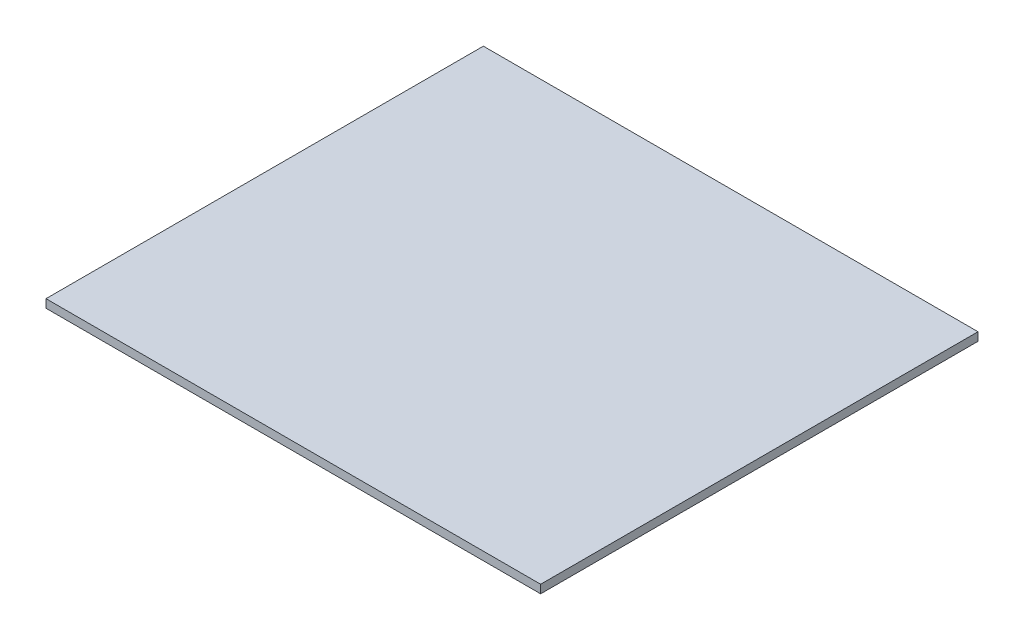
ISO-10303-21;
HEADER;
FILE_DESCRIPTION(('STEP AP214'),'2;1');
FILE_NAME('part.step','',(''),(''),'','','');
FILE_SCHEMA(('AUTOMOTIVE_DESIGN { 1 0 10303 214 1 1 1 1 }'));
ENDSEC;
DATA;
#1=APPLICATION_CONTEXT('core data for automotive mechanical design processes');
#2=APPLICATION_PROTOCOL_DEFINITION('international standard','automotive_design',2000,#1);
#3=PRODUCT_CONTEXT('',#1,'mechanical');
#4=PRODUCT('Part','Part','',(#3));
#5=PRODUCT_RELATED_PRODUCT_CATEGORY('part','',(#4));
#6=PRODUCT_DEFINITION_FORMATION('','',#4);
#7=PRODUCT_DEFINITION_CONTEXT('part definition',#1,'design');
#8=PRODUCT_DEFINITION('design','',#6,#7);
#9=PRODUCT_DEFINITION_SHAPE('','',#8);
#10=(LENGTH_UNIT() NAMED_UNIT(*) SI_UNIT(.MILLI.,.METRE.));
#11=(NAMED_UNIT(*) PLANE_ANGLE_UNIT() SI_UNIT($,.RADIAN.));
#12=(NAMED_UNIT(*) SI_UNIT($,.STERADIAN.) SOLID_ANGLE_UNIT());
#13=UNCERTAINTY_MEASURE_WITH_UNIT(LENGTH_MEASURE(1.E-05),#10,'distance_accuracy_value','');
#14=(GEOMETRIC_REPRESENTATION_CONTEXT(3) GLOBAL_UNCERTAINTY_ASSIGNED_CONTEXT((#13)) GLOBAL_UNIT_ASSIGNED_CONTEXT((#10,
#11,#12)) REPRESENTATION_CONTEXT('',''));
#15=CARTESIAN_POINT('',(0.,0.,0.));
#16=DIRECTION('',(0.,0.,1.));
#17=DIRECTION('',(1.,0.,0.));
#18=AXIS2_PLACEMENT_3D('',#15,#16,#17);
#19=CARTESIAN_POINT('',(0.,16.,0.));
#20=DIRECTION('',(1.,0.,0.));
#21=DIRECTION('',(0.,0.,-1.));
#22=AXIS2_PLACEMENT_3D('',#19,#20,#21);
#23=PLANE('',#22);
#24=DIRECTION('',(0.,0.,1.));
#25=VECTOR('',#24,1.);
#26=CARTESIAN_POINT('',(0.,0.,0.));
#27=LINE('',#26,#25);
#28=CARTESIAN_POINT('',(0.,0.,-840.));
#29=VERTEX_POINT('',#28);
#30=CARTESIAN_POINT('',(0.,0.,0.));
#31=VERTEX_POINT('',#30);
#32=EDGE_CURVE('E97',#29,#31,#27,.T.);
#33=ORIENTED_EDGE('',*,*,#32,.T.);
#34=DIRECTION('',(0.,-1.,0.));
#35=VECTOR('',#34,1.);
#36=CARTESIAN_POINT('',(0.,16.,0.));
#37=LINE('',#36,#35);
#38=CARTESIAN_POINT('',(0.,16.,0.));
#39=VERTEX_POINT('',#38);
#40=EDGE_CURVE('E11',#39,#31,#37,.T.);
#41=ORIENTED_EDGE('',*,*,#40,.F.);
#42=DIRECTION('',(0.,0.,1.));
#43=VECTOR('',#42,1.);
#44=CARTESIAN_POINT('',(0.,16.,0.));
#45=LINE('',#44,#43);
#46=CARTESIAN_POINT('',(0.,16.,-840.));
#47=VERTEX_POINT('',#46);
#48=EDGE_CURVE('E85',#47,#39,#45,.T.);
#49=ORIENTED_EDGE('',*,*,#48,.F.);
#50=DIRECTION('',(0.,-1.,0.));
#51=VECTOR('',#50,1.);
#52=CARTESIAN_POINT('',(0.,16.,-840.));
#53=LINE('',#52,#51);
#54=EDGE_CURVE('E93',#47,#29,#53,.T.);
#55=ORIENTED_EDGE('',*,*,#54,.T.);
#56=EDGE_LOOP('',(#33,#41,#49,#55));
#57=FACE_BOUND('',#56,.T.);
#58=ADVANCED_FACE('F34',(#57),#23,.F.);
#59=CARTESIAN_POINT('',(0.,16.,0.));
#60=DIRECTION('',(0.,0.,-1.));
#61=DIRECTION('',(-1.,0.,0.));
#62=AXIS2_PLACEMENT_3D('',#59,#60,#61);
#63=PLANE('',#62);
#64=DIRECTION('',(1.,0.,0.));
#65=VECTOR('',#64,1.);
#66=CARTESIAN_POINT('',(0.,0.,0.));
#67=LINE('',#66,#65);
#68=CARTESIAN_POINT('',(950.,0.,0.));
#69=VERTEX_POINT('',#68);
#70=EDGE_CURVE('E89',#31,#69,#67,.T.);
#71=ORIENTED_EDGE('',*,*,#70,.T.);
#72=DIRECTION('',(0.,-1.,0.));
#73=VECTOR('',#72,1.);
#74=CARTESIAN_POINT('',(950.,16.,0.));
#75=LINE('',#74,#73);
#76=CARTESIAN_POINT('',(950.,16.,0.));
#77=VERTEX_POINT('',#76);
#78=EDGE_CURVE('E42',#77,#69,#75,.T.);
#79=ORIENTED_EDGE('',*,*,#78,.F.);
#80=DIRECTION('',(1.,0.,0.));
#81=VECTOR('',#80,1.);
#82=CARTESIAN_POINT('',(0.,16.,0.));
#83=LINE('',#82,#81);
#84=EDGE_CURVE('E80',#39,#77,#83,.T.);
#85=ORIENTED_EDGE('',*,*,#84,.F.);
#86=ORIENTED_EDGE('',*,*,#40,.T.);
#87=EDGE_LOOP('',(#71,#79,#85,#86));
#88=FACE_BOUND('',#87,.T.);
#89=ADVANCED_FACE('F88',(#88),#63,.F.);
#90=CARTESIAN_POINT('',(950.,16.,0.));
#91=DIRECTION('',(-1.,0.,0.));
#92=DIRECTION('',(0.,0.,1.));
#93=AXIS2_PLACEMENT_3D('',#90,#91,#92);
#94=PLANE('',#93);
#95=DIRECTION('',(0.,0.,-1.));
#96=VECTOR('',#95,1.);
#97=CARTESIAN_POINT('',(950.,0.,0.));
#98=LINE('',#97,#96);
#99=CARTESIAN_POINT('',(950.,0.,-840.));
#100=VERTEX_POINT('',#99);
#101=EDGE_CURVE('E67',#69,#100,#98,.T.);
#102=ORIENTED_EDGE('',*,*,#101,.T.);
#103=DIRECTION('',(0.,-1.,0.));
#104=VECTOR('',#103,1.);
#105=CARTESIAN_POINT('',(950.,16.,-840.));
#106=LINE('',#105,#104);
#107=CARTESIAN_POINT('',(950.,16.,-840.));
#108=VERTEX_POINT('',#107);
#109=EDGE_CURVE('E90',#108,#100,#106,.T.);
#110=ORIENTED_EDGE('',*,*,#109,.F.);
#111=DIRECTION('',(0.,0.,-1.));
#112=VECTOR('',#111,1.);
#113=CARTESIAN_POINT('',(950.,16.,0.));
#114=LINE('',#113,#112);
#115=EDGE_CURVE('E83',#77,#108,#114,.T.);
#116=ORIENTED_EDGE('',*,*,#115,.F.);
#117=ORIENTED_EDGE('',*,*,#78,.T.);
#118=EDGE_LOOP('',(#102,#110,#116,#117));
#119=FACE_BOUND('',#118,.T.);
#120=ADVANCED_FACE('F91',(#119),#94,.F.);
#121=CARTESIAN_POINT('',(0.,16.,-840.));
#122=DIRECTION('',(0.,0.,1.));
#123=DIRECTION('',(1.,0.,0.));
#124=AXIS2_PLACEMENT_3D('',#121,#122,#123);
#125=PLANE('',#124);
#126=DIRECTION('',(-1.,0.,0.));
#127=VECTOR('',#126,1.);
#128=CARTESIAN_POINT('',(0.,0.,-840.));
#129=LINE('',#128,#127);
#130=EDGE_CURVE('E73',#100,#29,#129,.T.);
#131=ORIENTED_EDGE('',*,*,#130,.T.);
#132=ORIENTED_EDGE('',*,*,#54,.F.);
#133=DIRECTION('',(-1.,0.,0.));
#134=VECTOR('',#133,1.);
#135=CARTESIAN_POINT('',(0.,16.,-840.));
#136=LINE('',#135,#134);
#137=EDGE_CURVE('E50',#108,#47,#136,.T.);
#138=ORIENTED_EDGE('',*,*,#137,.F.);
#139=ORIENTED_EDGE('',*,*,#109,.T.);
#140=EDGE_LOOP('',(#131,#132,#138,#139));
#141=FACE_BOUND('',#140,.T.);
#142=ADVANCED_FACE('F104',(#141),#125,.F.);
#143=CARTESIAN_POINT('',(0.,16.,0.));
#144=DIRECTION('',(0.,-1.,0.));
#145=DIRECTION('',(0.,0.,-1.));
#146=AXIS2_PLACEMENT_3D('',#143,#144,#145);
#147=PLANE('',#146);
#148=ORIENTED_EDGE('',*,*,#48,.T.);
#149=ORIENTED_EDGE('',*,*,#84,.T.);
#150=ORIENTED_EDGE('',*,*,#115,.T.);
#151=ORIENTED_EDGE('',*,*,#137,.T.);
#152=EDGE_LOOP('',(#148,#149,#150,#151));
#153=FACE_BOUND('',#152,.T.);
#154=ADVANCED_FACE('F81',(#153),#147,.F.);
#155=CARTESIAN_POINT('',(0.,0.,0.));
#156=DIRECTION('',(0.,-1.,0.));
#157=DIRECTION('',(0.,0.,-1.));
#158=AXIS2_PLACEMENT_3D('',#155,#156,#157);
#159=PLANE('',#158);
#160=ORIENTED_EDGE('',*,*,#32,.F.);
#161=ORIENTED_EDGE('',*,*,#130,.F.);
#162=ORIENTED_EDGE('',*,*,#101,.F.);
#163=ORIENTED_EDGE('',*,*,#70,.F.);
#164=EDGE_LOOP('',(#160,#161,#162,#163));
#165=FACE_BOUND('',#164,.T.);
#166=ADVANCED_FACE('F107',(#165),#159,.T.);
#167=CLOSED_SHELL('',(#58,#89,#120,#142,#154,#166));
#168=MANIFOLD_SOLID_BREP('B2',#167);
#169=ADVANCED_BREP_SHAPE_REPRESENTATION('',(#18,#168),#14);
#170=SHAPE_DEFINITION_REPRESENTATION(#9,#169);
ENDSEC;
END-ISO-10303-21;
